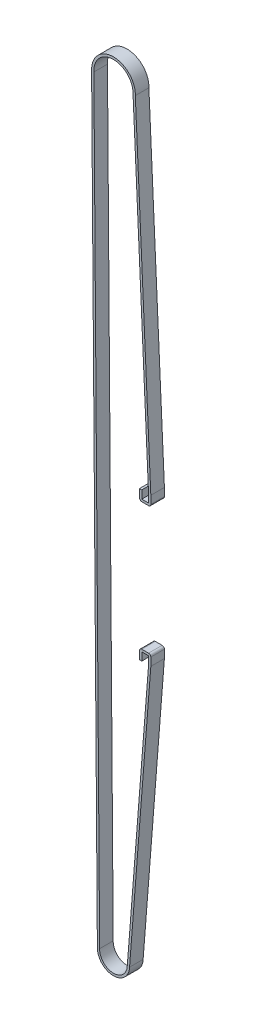
ISO-10303-21;
HEADER;
FILE_DESCRIPTION(('STEP AP214'),'2;1');
FILE_NAME('part.step','',(''),(''),'','','');
FILE_SCHEMA(('AUTOMOTIVE_DESIGN { 1 0 10303 214 1 1 1 1 }'));
ENDSEC;
DATA;
#1=APPLICATION_CONTEXT('core data for automotive mechanical design processes');
#2=APPLICATION_PROTOCOL_DEFINITION('international standard','automotive_design',2000,#1);
#3=PRODUCT_CONTEXT('',#1,'mechanical');
#4=PRODUCT('Part','Part','',(#3));
#5=PRODUCT_RELATED_PRODUCT_CATEGORY('part','',(#4));
#6=PRODUCT_DEFINITION_FORMATION('','',#4);
#7=PRODUCT_DEFINITION_CONTEXT('part definition',#1,'design');
#8=PRODUCT_DEFINITION('design','',#6,#7);
#9=PRODUCT_DEFINITION_SHAPE('','',#8);
#10=(LENGTH_UNIT() NAMED_UNIT(*) SI_UNIT(.MILLI.,.METRE.));
#11=(NAMED_UNIT(*) PLANE_ANGLE_UNIT() SI_UNIT($,.RADIAN.));
#12=(NAMED_UNIT(*) SI_UNIT($,.STERADIAN.) SOLID_ANGLE_UNIT());
#13=UNCERTAINTY_MEASURE_WITH_UNIT(LENGTH_MEASURE(1.E-05),#10,'distance_accuracy_value','');
#14=(GEOMETRIC_REPRESENTATION_CONTEXT(3) GLOBAL_UNCERTAINTY_ASSIGNED_CONTEXT((#13)) GLOBAL_UNIT_ASSIGNED_CONTEXT((#10,
#11,#12)) REPRESENTATION_CONTEXT('',''));
#15=CARTESIAN_POINT('',(0.,0.,0.));
#16=DIRECTION('',(0.,0.,1.));
#17=DIRECTION('',(1.,0.,0.));
#18=AXIS2_PLACEMENT_3D('',#15,#16,#17);
#19=CARTESIAN_POINT('',(49.3545558516404,0.375647011422282,66.5186934273262));
#20=DIRECTION('',(-0.999971036134917,-0.00761097176848917,0.));
#21=DIRECTION('',(0.00761097176848917,-0.999971036134917,0.));
#22=AXIS2_PLACEMENT_3D('',#19,#20,#21);
#23=PLANE('',#22);
#24=DIRECTION('',(0.,0.,1.));
#25=VECTOR('',#24,1.);
#26=CARTESIAN_POINT('',(50.9787372014678,-213.018168740484,66.5186934273254));
#27=LINE('',#26,#25);
#28=CARTESIAN_POINT('',(50.9787372014678,-213.018168740484,66.5186934273254));
#29=VERTEX_POINT('',#28);
#30=CARTESIAN_POINT('',(50.9787372014678,-213.018168740484,72.5186934273254));
#31=VERTEX_POINT('',#30);
#32=EDGE_CURVE('E221',#29,#31,#27,.T.);
#33=ORIENTED_EDGE('',*,*,#32,.T.);
#34=DIRECTION('',(0.00761097176848917,-0.999971036134917,0.));
#35=VECTOR('',#34,1.);
#36=CARTESIAN_POINT('',(49.3545558516404,0.375647011422261,72.5186934273262));
#37=LINE('',#36,#35);
#38=CARTESIAN_POINT('',(48.4304659183721,121.787629102586,72.5186934273266));
#39=VERTEX_POINT('',#38);
#40=EDGE_CURVE('E224',#39,#31,#37,.T.);
#41=ORIENTED_EDGE('',*,*,#40,.F.);
#42=DIRECTION('',(0.,0.,1.));
#43=VECTOR('',#42,1.);
#44=CARTESIAN_POINT('',(48.4304659183721,121.787629102586,66.5186934273266));
#45=LINE('',#44,#43);
#46=CARTESIAN_POINT('',(48.4304659183721,121.787629102586,66.5186934273266));
#47=VERTEX_POINT('',#46);
#48=EDGE_CURVE('E365',#47,#39,#45,.T.);
#49=ORIENTED_EDGE('',*,*,#48,.F.);
#50=DIRECTION('',(0.00761097176848917,-0.999971036134917,0.));
#51=VECTOR('',#50,1.);
#52=CARTESIAN_POINT('',(49.3545558516404,0.375647011422282,66.5186934273262));
#53=LINE('',#52,#51);
#54=EDGE_CURVE('E226',#47,#29,#53,.T.);
#55=ORIENTED_EDGE('',*,*,#54,.T.);
#56=EDGE_LOOP('',(#33,#41,#49,#55));
#57=FACE_BOUND('',#56,.T.);
#58=ADVANCED_FACE('F35',(#57),#23,.T.);
#59=CARTESIAN_POINT('',(58.0839171363472,121.431989422327,66.5186934273266));
#60=DIRECTION('',(0.,0.,1.));
#61=DIRECTION('',(0.,-1.,0.));
#62=AXIS2_PLACEMENT_3D('',#59,#60,#61);
#63=CYLINDRICAL_SURFACE('',#62,9.66);
#64=ORIENTED_EDGE('',*,*,#48,.T.);
#65=CARTESIAN_POINT('',(58.0839171363472,121.431989422327,72.5186934273266));
#66=DIRECTION('',(0.,0.,1.));
#67=DIRECTION('',(0.,-1.,0.));
#68=AXIS2_PLACEMENT_3D('',#65,#66,#67);
#69=CIRCLE('',#68,9.66);
#70=CARTESIAN_POINT('',(67.7373683543224,121.076349742068,72.5186934273266));
#71=VERTEX_POINT('',#70);
#72=EDGE_CURVE('E247',#71,#39,#69,.T.);
#73=ORIENTED_EDGE('',*,*,#72,.F.);
#74=DIRECTION('',(0.,0.,1.));
#75=VECTOR('',#74,1.);
#76=CARTESIAN_POINT('',(67.7373683543224,121.076349742068,66.5186934273266));
#77=LINE('',#76,#75);
#78=CARTESIAN_POINT('',(67.7373683543224,121.076349742068,66.5186934273266));
#79=VERTEX_POINT('',#78);
#80=EDGE_CURVE('E368',#79,#71,#77,.T.);
#81=ORIENTED_EDGE('',*,*,#80,.F.);
#82=CARTESIAN_POINT('',(58.0839171363472,121.431989422327,66.5186934273266));
#83=DIRECTION('',(0.,0.,1.));
#84=DIRECTION('',(0.,-1.,0.));
#85=AXIS2_PLACEMENT_3D('',#82,#83,#84);
#86=CIRCLE('',#85,9.66);
#87=EDGE_CURVE('E231',#79,#47,#86,.T.);
#88=ORIENTED_EDGE('',*,*,#87,.T.);
#89=EDGE_LOOP('',(#64,#73,#81,#88));
#90=FACE_BOUND('',#89,.T.);
#91=ADVANCED_FACE('F532',(#90),#63,.T.);
#92=CARTESIAN_POINT('',(73.1316105789095,3.35092983353367,66.5186934273262));
#93=DIRECTION('',(0.998951889201217,0.0457725142560279,0.));
#94=DIRECTION('',(-0.0457725142560279,0.998951889201218,0.));
#95=AXIS2_PLACEMENT_3D('',#92,#93,#94);
#96=PLANE('',#95);
#97=ORIENTED_EDGE('',*,*,#80,.T.);
#98=DIRECTION('',(-0.0457725142560279,0.998951889201218,0.));
#99=VECTOR('',#98,1.);
#100=CARTESIAN_POINT('',(73.1316105789095,3.35092983353365,72.5186934273262));
#101=LINE('',#100,#99);
#102=CARTESIAN_POINT('',(74.5839171363475,-28.3446062940457,72.5186934273261));
#103=VERTEX_POINT('',#102);
#104=EDGE_CURVE('E306',#103,#71,#101,.T.);
#105=ORIENTED_EDGE('',*,*,#104,.F.);
#106=DIRECTION('',(0.,0.,1.));
#107=VECTOR('',#106,1.);
#108=CARTESIAN_POINT('',(74.5839171363475,-28.3446062940457,66.5186934273261));
#109=LINE('',#108,#107);
#110=CARTESIAN_POINT('',(74.5839171363475,-28.3446062940457,66.5186934273261));
#111=VERTEX_POINT('',#110);
#112=EDGE_CURVE('E370',#111,#103,#109,.T.);
#113=ORIENTED_EDGE('',*,*,#112,.F.);
#114=DIRECTION('',(-0.0457725142560279,0.998951889201218,0.));
#115=VECTOR('',#114,1.);
#116=CARTESIAN_POINT('',(73.1316105789095,3.35092983353367,66.5186934273262));
#117=LINE('',#116,#115);
#118=EDGE_CURVE('E360',#111,#79,#117,.T.);
#119=ORIENTED_EDGE('',*,*,#118,.T.);
#120=EDGE_LOOP('',(#97,#105,#113,#119));
#121=FACE_BOUND('',#120,.T.);
#122=ADVANCED_FACE('F536',(#121),#96,.T.);
#123=CARTESIAN_POINT('',(74.5839171363475,0.,66.5186934273262));
#124=DIRECTION('',(1.,0.,0.));
#125=DIRECTION('',(0.,1.,0.));
#126=AXIS2_PLACEMENT_3D('',#123,#124,#125);
#127=PLANE('',#126);
#128=DIRECTION('',(0.,1.,0.));
#129=VECTOR('',#128,1.);
#130=CARTESIAN_POINT('',(74.5839171363475,0.,72.5186934273262));
#131=LINE('',#130,#129);
#132=CARTESIAN_POINT('',(74.5839171363475,-31.8299283809652,72.5186934273261));
#133=VERTEX_POINT('',#132);
#134=EDGE_CURVE('E304',#133,#103,#131,.T.);
#135=ORIENTED_EDGE('',*,*,#134,.F.);
#136=DIRECTION('',(0.,0.,1.));
#137=VECTOR('',#136,1.);
#138=CARTESIAN_POINT('',(74.5839171363475,-31.8299283809652,66.5186934273261));
#139=LINE('',#138,#137);
#140=CARTESIAN_POINT('',(74.5839171363475,-31.8299283809652,66.5186934273261));
#141=VERTEX_POINT('',#140);
#142=EDGE_CURVE('E11',#133,#141,#139,.F.);
#143=ORIENTED_EDGE('',*,*,#142,.T.);
#144=DIRECTION('',(0.,1.,0.));
#145=VECTOR('',#144,1.);
#146=CARTESIAN_POINT('',(74.5839171363475,0.,66.5186934273262));
#147=LINE('',#146,#145);
#148=EDGE_CURVE('E358',#141,#111,#147,.T.);
#149=ORIENTED_EDGE('',*,*,#148,.T.);
#150=ORIENTED_EDGE('',*,*,#112,.T.);
#151=EDGE_LOOP('',(#135,#143,#149,#150));
#152=FACE_BOUND('',#151,.T.);
#153=ADVANCED_FACE('F541',(#152),#127,.T.);
#154=CARTESIAN_POINT('',(1.82279723997927E-13,-32.8299283809656,66.5186934273261));
#155=DIRECTION('',(0.,-1.,0.));
#156=DIRECTION('',(1.,0.,0.));
#157=AXIS2_PLACEMENT_3D('',#154,#155,#156);
#158=PLANE('',#157);
#159=DIRECTION('',(1.,0.,0.));
#160=VECTOR('',#159,1.);
#161=CARTESIAN_POINT('',(1.822056998555E-13,-32.8299283809656,72.5186934273261));
#162=LINE('',#161,#160);
#163=CARTESIAN_POINT('',(70.5839171363476,-32.8299283809652,72.5186934273261));
#164=VERTEX_POINT('',#163);
#165=CARTESIAN_POINT('',(73.5839171363475,-32.8299283809652,72.5186934273261));
#166=VERTEX_POINT('',#165);
#167=EDGE_CURVE('E301',#164,#166,#162,.T.);
#168=ORIENTED_EDGE('',*,*,#167,.F.);
#169=DIRECTION('',(0.,0.,1.));
#170=VECTOR('',#169,1.);
#171=CARTESIAN_POINT('',(70.5839171363476,-32.8299283809652,66.5186934273261));
#172=LINE('',#171,#170);
#173=CARTESIAN_POINT('',(70.5839171363476,-32.8299283809652,66.5186934273261));
#174=VERTEX_POINT('',#173);
#175=EDGE_CURVE('E43',#164,#174,#172,.F.);
#176=ORIENTED_EDGE('',*,*,#175,.T.);
#177=DIRECTION('',(1.,0.,0.));
#178=VECTOR('',#177,1.);
#179=CARTESIAN_POINT('',(1.82279723997927E-13,-32.8299283809656,66.5186934273261));
#180=LINE('',#179,#178);
#181=CARTESIAN_POINT('',(73.5839171363475,-32.8299283809652,66.5186934273261));
#182=VERTEX_POINT('',#181);
#183=EDGE_CURVE('E355',#174,#182,#180,.T.);
#184=ORIENTED_EDGE('',*,*,#183,.T.);
#185=DIRECTION('',(0.,0.,1.));
#186=VECTOR('',#185,1.);
#187=CARTESIAN_POINT('',(73.5839171363475,-32.8299283809652,66.5186934273261));
#188=LINE('',#187,#186);
#189=EDGE_CURVE('E431',#182,#166,#188,.T.);
#190=ORIENTED_EDGE('',*,*,#189,.T.);
#191=EDGE_LOOP('',(#168,#176,#184,#190));
#192=FACE_BOUND('',#191,.T.);
#193=ADVANCED_FACE('F436',(#192),#158,.T.);
#194=CARTESIAN_POINT('',(69.5839171363476,-2.32212261237888E-13,66.5186934273262));
#195=DIRECTION('',(-1.,0.,0.));
#196=DIRECTION('',(0.,0.,1.));
#197=AXIS2_PLACEMENT_3D('',#194,#195,#196);
#198=PLANE('',#197);
#199=DIRECTION('',(0.,-1.,0.));
#200=VECTOR('',#199,1.);
#201=CARTESIAN_POINT('',(69.5839171363476,-2.32212261237888E-13,66.5186934273262));
#202=LINE('',#201,#200);
#203=CARTESIAN_POINT('',(69.5839171363476,-28.2799283809651,66.5186934273261));
#204=VERTEX_POINT('',#203);
#205=CARTESIAN_POINT('',(69.5839171363476,-31.8299283809652,66.5186934273261));
#206=VERTEX_POINT('',#205);
#207=EDGE_CURVE('E353',#204,#206,#202,.T.);
#208=ORIENTED_EDGE('',*,*,#207,.T.);
#209=DIRECTION('',(0.,0.,1.));
#210=VECTOR('',#209,1.);
#211=CARTESIAN_POINT('',(69.5839171363476,-31.8299283809652,66.5186934273261));
#212=LINE('',#211,#210);
#213=CARTESIAN_POINT('',(69.5839171363476,-31.8299283809652,72.5186934273261));
#214=VERTEX_POINT('',#213);
#215=EDGE_CURVE('E428',#206,#214,#212,.T.);
#216=ORIENTED_EDGE('',*,*,#215,.T.);
#217=DIRECTION('',(0.,-1.,0.));
#218=VECTOR('',#217,1.);
#219=CARTESIAN_POINT('',(69.5839171363476,-2.53184318683104E-13,72.5186934273262));
#220=LINE('',#219,#218);
#221=CARTESIAN_POINT('',(69.5839171363476,-28.2799283809652,72.5186934273261));
#222=VERTEX_POINT('',#221);
#223=EDGE_CURVE('E298',#222,#214,#220,.T.);
#224=ORIENTED_EDGE('',*,*,#223,.F.);
#225=DIRECTION('',(0.,0.,1.));
#226=VECTOR('',#225,1.);
#227=CARTESIAN_POINT('',(69.5839171363476,-28.2799283809651,66.5186934273261));
#228=LINE('',#227,#226);
#229=EDGE_CURVE('E373',#204,#222,#228,.T.);
#230=ORIENTED_EDGE('',*,*,#229,.F.);
#231=EDGE_LOOP('',(#208,#216,#224,#230));
#232=FACE_BOUND('',#231,.T.);
#233=ADVANCED_FACE('F446',(#232),#198,.T.);
#234=CARTESIAN_POINT('',(-1.56981436909345E-12,-28.2799283809613,66.5186934273261));
#235=DIRECTION('',(0.,1.,0.));
#236=DIRECTION('',(-1.,0.,0.));
#237=AXIS2_PLACEMENT_3D('',#234,#235,#236);
#238=PLANE('',#237);
#239=ORIENTED_EDGE('',*,*,#229,.T.);
#240=DIRECTION('',(-1.,0.,0.));
#241=VECTOR('',#240,1.);
#242=CARTESIAN_POINT('',(-1.56988839323588E-12,-28.2799283809613,72.5186934273261));
#243=LINE('',#242,#241);
#244=CARTESIAN_POINT('',(70.5839171363476,-28.2799283809652,72.5186934273261));
#245=VERTEX_POINT('',#244);
#246=EDGE_CURVE('E295',#245,#222,#243,.T.);
#247=ORIENTED_EDGE('',*,*,#246,.F.);
#248=DIRECTION('',(0.,0.,1.));
#249=VECTOR('',#248,1.);
#250=CARTESIAN_POINT('',(70.5839171363476,-28.2799283809652,66.5186934273261));
#251=LINE('',#250,#249);
#252=CARTESIAN_POINT('',(70.5839171363476,-28.2799283809652,66.5186934273261));
#253=VERTEX_POINT('',#252);
#254=EDGE_CURVE('E375',#253,#245,#251,.T.);
#255=ORIENTED_EDGE('',*,*,#254,.F.);
#256=DIRECTION('',(-1.,0.,0.));
#257=VECTOR('',#256,1.);
#258=CARTESIAN_POINT('',(-1.56981436909345E-12,-28.2799283809613,66.5186934273261));
#259=LINE('',#258,#257);
#260=EDGE_CURVE('E350',#253,#204,#259,.T.);
#261=ORIENTED_EDGE('',*,*,#260,.T.);
#262=EDGE_LOOP('',(#239,#247,#255,#261));
#263=FACE_BOUND('',#262,.T.);
#264=ADVANCED_FACE('F450',(#263),#238,.T.);
#265=CARTESIAN_POINT('',(70.5839171363481,-1.6118582114669E-12,66.5186934273262));
#266=DIRECTION('',(1.,0.,0.));
#267=DIRECTION('',(0.,1.,0.));
#268=AXIS2_PLACEMENT_3D('',#265,#266,#267);
#269=PLANE('',#268);
#270=ORIENTED_EDGE('',*,*,#254,.T.);
#271=DIRECTION('',(0.,1.,0.));
#272=VECTOR('',#271,1.);
#273=CARTESIAN_POINT('',(70.5839171363481,-1.63283026891212E-12,72.5186934273262));
#274=LINE('',#273,#272);
#275=CARTESIAN_POINT('',(70.5839171363475,-31.8299283809652,72.5186934273261));
#276=VERTEX_POINT('',#275);
#277=EDGE_CURVE('E292',#276,#245,#274,.T.);
#278=ORIENTED_EDGE('',*,*,#277,.F.);
#279=DIRECTION('',(0.,0.,1.));
#280=VECTOR('',#279,1.);
#281=CARTESIAN_POINT('',(70.5839171363475,-31.8299283809652,66.5186934273261));
#282=LINE('',#281,#280);
#283=CARTESIAN_POINT('',(70.5839171363475,-31.8299283809652,66.5186934273261));
#284=VERTEX_POINT('',#283);
#285=EDGE_CURVE('E377',#284,#276,#282,.T.);
#286=ORIENTED_EDGE('',*,*,#285,.F.);
#287=DIRECTION('',(0.,1.,0.));
#288=VECTOR('',#287,1.);
#289=CARTESIAN_POINT('',(70.5839171363481,-1.6118582114669E-12,66.5186934273262));
#290=LINE('',#289,#288);
#291=EDGE_CURVE('E347',#284,#253,#290,.T.);
#292=ORIENTED_EDGE('',*,*,#291,.T.);
#293=EDGE_LOOP('',(#270,#278,#286,#292));
#294=FACE_BOUND('',#293,.T.);
#295=ADVANCED_FACE('F455',(#294),#269,.T.);
#296=CARTESIAN_POINT('',(0.,-31.8299283809652,66.5186934273261));
#297=DIRECTION('',(0.,1.,0.));
#298=DIRECTION('',(0.,0.,1.));
#299=AXIS2_PLACEMENT_3D('',#296,#297,#298);
#300=PLANE('',#299);
#301=ORIENTED_EDGE('',*,*,#285,.T.);
#302=DIRECTION('',(-1.,0.,0.));
#303=VECTOR('',#302,1.);
#304=CARTESIAN_POINT('',(0.,-31.8299283809652,72.5186934273261));
#305=LINE('',#304,#303);
#306=CARTESIAN_POINT('',(73.5839171363475,-31.8299283809652,72.5186934273261));
#307=VERTEX_POINT('',#306);
#308=EDGE_CURVE('E289',#307,#276,#305,.T.);
#309=ORIENTED_EDGE('',*,*,#308,.F.);
#310=DIRECTION('',(0.,0.,1.));
#311=VECTOR('',#310,1.);
#312=CARTESIAN_POINT('',(73.5839171363475,-31.8299283809652,66.5186934273261));
#313=LINE('',#312,#311);
#314=CARTESIAN_POINT('',(73.5839171363475,-31.8299283809652,66.5186934273261));
#315=VERTEX_POINT('',#314);
#316=EDGE_CURVE('E379',#315,#307,#313,.T.);
#317=ORIENTED_EDGE('',*,*,#316,.F.);
#318=DIRECTION('',(-1.,0.,0.));
#319=VECTOR('',#318,1.);
#320=CARTESIAN_POINT('',(0.,-31.8299283809652,66.5186934273261));
#321=LINE('',#320,#319);
#322=EDGE_CURVE('E344',#315,#284,#321,.T.);
#323=ORIENTED_EDGE('',*,*,#322,.T.);
#324=EDGE_LOOP('',(#301,#309,#317,#323));
#325=FACE_BOUND('',#324,.T.);
#326=ADVANCED_FACE('F458',(#325),#300,.T.);
#327=CARTESIAN_POINT('',(73.5839171363481,-1.67049675149992E-12,66.5186934273262));
#328=DIRECTION('',(-1.,0.,0.));
#329=DIRECTION('',(0.,-1.,0.));
#330=AXIS2_PLACEMENT_3D('',#327,#328,#329);
#331=PLANE('',#330);
#332=ORIENTED_EDGE('',*,*,#316,.T.);
#333=DIRECTION('',(0.,-1.,0.));
#334=VECTOR('',#333,1.);
#335=CARTESIAN_POINT('',(73.5839171363481,-1.69146880894514E-12,72.5186934273262));
#336=LINE('',#335,#334);
#337=CARTESIAN_POINT('',(73.5839171363475,-28.2799283809652,72.5186934273261));
#338=VERTEX_POINT('',#337);
#339=EDGE_CURVE('E286',#338,#307,#336,.T.);
#340=ORIENTED_EDGE('',*,*,#339,.F.);
#341=DIRECTION('',(0.,0.,1.));
#342=VECTOR('',#341,1.);
#343=CARTESIAN_POINT('',(73.5839171363475,-28.2799283809652,66.5186934273261));
#344=LINE('',#343,#342);
#345=CARTESIAN_POINT('',(73.5839171363475,-28.2799283809652,66.5186934273261));
#346=VERTEX_POINT('',#345);
#347=EDGE_CURVE('E381',#346,#338,#344,.T.);
#348=ORIENTED_EDGE('',*,*,#347,.F.);
#349=DIRECTION('',(0.,-1.,0.));
#350=VECTOR('',#349,1.);
#351=CARTESIAN_POINT('',(73.5839171363481,-1.67049675149992E-12,66.5186934273262));
#352=LINE('',#351,#350);
#353=EDGE_CURVE('E341',#346,#315,#352,.T.);
#354=ORIENTED_EDGE('',*,*,#353,.T.);
#355=EDGE_LOOP('',(#332,#340,#348,#354));
#356=FACE_BOUND('',#355,.T.);
#357=ADVANCED_FACE('F463',(#356),#331,.T.);
#358=CARTESIAN_POINT('',(72.1362158655848,3.3062468217902,66.5186934273262));
#359=DIRECTION('',(-0.998951302453346,-0.0457853178078266,0.));
#360=DIRECTION('',(0.0457853178078266,-0.998951302453346,0.));
#361=AXIS2_PLACEMENT_3D('',#358,#359,#360);
#362=PLANE('',#361);
#363=ORIENTED_EDGE('',*,*,#347,.T.);
#364=DIRECTION('',(0.0457853178078266,-0.998951302453346,0.));
#365=VECTOR('',#364,1.);
#366=CARTESIAN_POINT('',(72.1362158655848,3.30624682179018,72.5186934273262));
#367=LINE('',#366,#365);
#368=CARTESIAN_POINT('',(66.7367239922389,121.113214158011,72.5186934273266));
#369=VERTEX_POINT('',#368);
#370=EDGE_CURVE('E283',#369,#338,#367,.T.);
#371=ORIENTED_EDGE('',*,*,#370,.F.);
#372=DIRECTION('',(0.,0.,1.));
#373=VECTOR('',#372,1.);
#374=CARTESIAN_POINT('',(66.7367239922389,121.113214158011,66.5186934273266));
#375=LINE('',#374,#373);
#376=CARTESIAN_POINT('',(66.7367239922389,121.113214158011,66.5186934273266));
#377=VERTEX_POINT('',#376);
#378=EDGE_CURVE('E383',#377,#369,#375,.T.);
#379=ORIENTED_EDGE('',*,*,#378,.F.);
#380=DIRECTION('',(0.0457853178078266,-0.998951302453346,0.));
#381=VECTOR('',#380,1.);
#382=CARTESIAN_POINT('',(72.1362158655848,3.3062468217902,66.5186934273262));
#383=LINE('',#382,#381);
#384=EDGE_CURVE('E338',#377,#346,#383,.T.);
#385=ORIENTED_EDGE('',*,*,#384,.T.);
#386=EDGE_LOOP('',(#363,#371,#379,#385));
#387=FACE_BOUND('',#386,.T.);
#388=ADVANCED_FACE('F467',(#387),#362,.T.);
#389=CARTESIAN_POINT('',(58.0839171363472,121.431989422327,66.5186934273266));
#390=DIRECTION('',(0.,0.,1.));
#391=DIRECTION('',(0.,-1.,0.));
#392=AXIS2_PLACEMENT_3D('',#389,#390,#391);
#393=CYLINDRICAL_SURFACE('',#392,8.6586768131456);
#394=ORIENTED_EDGE('',*,*,#378,.T.);
#395=CARTESIAN_POINT('',(58.0839171363472,121.431989422327,72.5186934273266));
#396=DIRECTION('',(0.,0.,1.));
#397=DIRECTION('',(0.,-1.,0.));
#398=AXIS2_PLACEMENT_3D('',#395,#396,#397);
#399=CIRCLE('',#398,8.6586768131456);
#400=CARTESIAN_POINT('',(49.436964917062,120.981543563312,72.5186934273266));
#401=VERTEX_POINT('',#400);
#402=EDGE_CURVE('E280',#369,#401,#399,.T.);
#403=ORIENTED_EDGE('',*,*,#402,.T.);
#404=DIRECTION('',(0.,0.,1.));
#405=VECTOR('',#404,1.);
#406=CARTESIAN_POINT('',(49.436964917062,120.981543563312,66.5186934273266));
#407=LINE('',#406,#405);
#408=CARTESIAN_POINT('',(49.436964917062,120.981543563312,66.5186934273266));
#409=VERTEX_POINT('',#408);
#410=EDGE_CURVE('E385',#409,#401,#407,.T.);
#411=ORIENTED_EDGE('',*,*,#410,.F.);
#412=CARTESIAN_POINT('',(58.0839171363472,121.431989422327,66.5186934273266));
#413=DIRECTION('',(0.,0.,1.));
#414=DIRECTION('',(0.,-1.,0.));
#415=AXIS2_PLACEMENT_3D('',#412,#413,#414);
#416=CIRCLE('',#415,8.6586768131456);
#417=EDGE_CURVE('E336',#377,#409,#416,.T.);
#418=ORIENTED_EDGE('',*,*,#417,.F.);
#419=EDGE_LOOP('',(#394,#403,#411,#418));
#420=FACE_BOUND('',#419,.T.);
#421=ADVANCED_FACE('F471',(#420),#393,.F.);
#422=CARTESIAN_POINT('',(50.3548533133488,0.383256983692733,66.5186934273262));
#423=DIRECTION('',(0.999971036661477,0.00761090258582103,0.));
#424=DIRECTION('',(-0.00761090258582103,0.999971036661477,0.));
#425=AXIS2_PLACEMENT_3D('',#422,#423,#424);
#426=PLANE('',#425);
#427=ORIENTED_EDGE('',*,*,#410,.T.);
#428=DIRECTION('',(-0.00761090258582103,0.999971036661477,0.));
#429=VECTOR('',#428,1.);
#430=CARTESIAN_POINT('',(50.3548533133488,0.383256983692712,72.5186934273262));
#431=LINE('',#430,#429);
#432=CARTESIAN_POINT('',(51.979358392283,-213.055032302782,72.5186934273254));
#433=VERTEX_POINT('',#432);
#434=EDGE_CURVE('E277',#433,#401,#431,.T.);
#435=ORIENTED_EDGE('',*,*,#434,.F.);
#436=DIRECTION('',(0.,0.,1.));
#437=VECTOR('',#436,1.);
#438=CARTESIAN_POINT('',(51.979358392283,-213.055032302782,66.5186934273254));
#439=LINE('',#438,#437);
#440=CARTESIAN_POINT('',(51.979358392283,-213.055032302782,66.5186934273254));
#441=VERTEX_POINT('',#440);
#442=EDGE_CURVE('E387',#441,#433,#439,.T.);
#443=ORIENTED_EDGE('',*,*,#442,.F.);
#444=DIRECTION('',(-0.00761090258582103,0.999971036661477,0.));
#445=VECTOR('',#444,1.);
#446=CARTESIAN_POINT('',(50.3548533133488,0.383256983692733,66.5186934273262));
#447=LINE('',#446,#445);
#448=EDGE_CURVE('E333',#441,#409,#447,.T.);
#449=ORIENTED_EDGE('',*,*,#448,.T.);
#450=EDGE_LOOP('',(#427,#435,#443,#449));
#451=FACE_BOUND('',#450,.T.);
#452=ADVANCED_FACE('F476',(#451),#426,.T.);
#453=CARTESIAN_POINT('',(58.0839171363468,-213.279928380965,66.5186934273254));
#454=DIRECTION('',(0.,0.,1.));
#455=DIRECTION('',(0.,-1.,0.));
#456=AXIS2_PLACEMENT_3D('',#453,#454,#455);
#457=CYLINDRICAL_SURFACE('',#456,6.10870000128574);
#458=ORIENTED_EDGE('',*,*,#442,.T.);
#459=CARTESIAN_POINT('',(58.0839171363468,-213.279928380965,72.5186934273254));
#460=DIRECTION('',(0.,0.,1.));
#461=DIRECTION('',(0.,-1.,0.));
#462=AXIS2_PLACEMENT_3D('',#459,#460,#461);
#463=CIRCLE('',#462,6.10870000128574);
#464=CARTESIAN_POINT('',(64.1884758804106,-213.504824459149,72.5186934273254));
#465=VERTEX_POINT('',#464);
#466=EDGE_CURVE('E274',#433,#465,#463,.T.);
#467=ORIENTED_EDGE('',*,*,#466,.T.);
#468=DIRECTION('',(0.,0.,1.));
#469=VECTOR('',#468,1.);
#470=CARTESIAN_POINT('',(64.1884758804106,-213.504824459149,66.5186934273254));
#471=LINE('',#470,#469);
#472=CARTESIAN_POINT('',(64.1884758804106,-213.504824459149,66.5186934273254));
#473=VERTEX_POINT('',#472);
#474=EDGE_CURVE('E389',#473,#465,#471,.T.);
#475=ORIENTED_EDGE('',*,*,#474,.F.);
#476=CARTESIAN_POINT('',(58.0839171363468,-213.279928380965,66.5186934273254));
#477=DIRECTION('',(0.,0.,1.));
#478=DIRECTION('',(0.,-1.,0.));
#479=AXIS2_PLACEMENT_3D('',#476,#477,#478);
#480=CIRCLE('',#479,6.10870000128574);
#481=EDGE_CURVE('E331',#441,#473,#480,.T.);
#482=ORIENTED_EDGE('',*,*,#481,.F.);
#483=EDGE_LOOP('',(#458,#467,#475,#482));
#484=FACE_BOUND('',#483,.T.);
#485=ADVANCED_FACE('F480',(#484),#457,.F.);
#486=CARTESIAN_POINT('',(80.4478930543302,-6.31316858995058,66.5186934273262));
#487=DIRECTION('',(0.99693496695121,-0.0782347216393729,0.));
#488=DIRECTION('',(0.0782347216393729,0.99693496695121,0.));
#489=AXIS2_PLACEMENT_3D('',#486,#487,#488);
#490=PLANE('',#489);
#491=ORIENTED_EDGE('',*,*,#474,.T.);
#492=DIRECTION('',(0.0782347216393729,0.99693496695121,0.));
#493=VECTOR('',#492,1.);
#494=CARTESIAN_POINT('',(80.4478930543302,-6.3131685899506,72.5186934273262));
#495=LINE('',#494,#493);
#496=CARTESIAN_POINT('',(73.5839171363476,-93.7799283809653,72.5186934273259));
#497=VERTEX_POINT('',#496);
#498=EDGE_CURVE('E271',#465,#497,#495,.T.);
#499=ORIENTED_EDGE('',*,*,#498,.T.);
#500=DIRECTION('',(0.,0.,1.));
#501=VECTOR('',#500,1.);
#502=CARTESIAN_POINT('',(73.5839171363476,-93.7799283809652,66.5186934273258));
#503=LINE('',#502,#501);
#504=CARTESIAN_POINT('',(73.5839171363476,-93.7799283809652,66.5186934273258));
#505=VERTEX_POINT('',#504);
#506=EDGE_CURVE('E391',#505,#497,#503,.T.);
#507=ORIENTED_EDGE('',*,*,#506,.F.);
#508=DIRECTION('',(0.0782347216393729,0.99693496695121,0.));
#509=VECTOR('',#508,1.);
#510=CARTESIAN_POINT('',(80.4478930543302,-6.31316858995058,66.5186934273262));
#511=LINE('',#510,#509);
#512=EDGE_CURVE('E329',#473,#505,#511,.T.);
#513=ORIENTED_EDGE('',*,*,#512,.F.);
#514=EDGE_LOOP('',(#491,#499,#507,#513));
#515=FACE_BOUND('',#514,.T.);
#516=ADVANCED_FACE('F485',(#515),#490,.F.);
#517=CARTESIAN_POINT('',(73.5839171363457,1.20607222902408E-12,66.5186934273262));
#518=DIRECTION('',(1.,0.,0.));
#519=DIRECTION('',(0.,1.,0.));
#520=AXIS2_PLACEMENT_3D('',#517,#518,#519);
#521=PLANE('',#520);
#522=ORIENTED_EDGE('',*,*,#506,.T.);
#523=DIRECTION('',(0.,1.,0.));
#524=VECTOR('',#523,1.);
#525=CARTESIAN_POINT('',(73.5839171363457,1.18510017157887E-12,72.5186934273262));
#526=LINE('',#525,#524);
#527=CARTESIAN_POINT('',(73.5839171363475,-90.2299283809652,72.5186934273259));
#528=VERTEX_POINT('',#527);
#529=EDGE_CURVE('E268',#497,#528,#526,.T.);
#530=ORIENTED_EDGE('',*,*,#529,.T.);
#531=DIRECTION('',(0.,0.,1.));
#532=VECTOR('',#531,1.);
#533=CARTESIAN_POINT('',(73.5839171363475,-90.2299283809652,66.5186934273259));
#534=LINE('',#533,#532);
#535=CARTESIAN_POINT('',(73.5839171363475,-90.2299283809652,66.5186934273259));
#536=VERTEX_POINT('',#535);
#537=EDGE_CURVE('E393',#536,#528,#534,.T.);
#538=ORIENTED_EDGE('',*,*,#537,.F.);
#539=DIRECTION('',(0.,1.,0.));
#540=VECTOR('',#539,1.);
#541=CARTESIAN_POINT('',(73.5839171363457,1.20607222902408E-12,66.5186934273262));
#542=LINE('',#541,#540);
#543=EDGE_CURVE('E327',#505,#536,#542,.T.);
#544=ORIENTED_EDGE('',*,*,#543,.F.);
#545=EDGE_LOOP('',(#522,#530,#538,#544));
#546=FACE_BOUND('',#545,.T.);
#547=ADVANCED_FACE('F491',(#546),#521,.F.);
#548=CARTESIAN_POINT('',(0.,-90.2299283809652,66.5186934273259));
#549=DIRECTION('',(0.,1.,0.));
#550=DIRECTION('',(0.,0.,1.));
#551=AXIS2_PLACEMENT_3D('',#548,#549,#550);
#552=PLANE('',#551);
#553=ORIENTED_EDGE('',*,*,#537,.T.);
#554=DIRECTION('',(-1.,0.,0.));
#555=VECTOR('',#554,1.);
#556=CARTESIAN_POINT('',(0.,-90.2299283809652,72.5186934273259));
#557=LINE('',#556,#555);
#558=CARTESIAN_POINT('',(70.5839171363476,-90.2299283809652,72.5186934273259));
#559=VERTEX_POINT('',#558);
#560=EDGE_CURVE('E265',#528,#559,#557,.T.);
#561=ORIENTED_EDGE('',*,*,#560,.T.);
#562=DIRECTION('',(0.,0.,1.));
#563=VECTOR('',#562,1.);
#564=CARTESIAN_POINT('',(70.5839171363476,-90.2299283809652,66.5186934273259));
#565=LINE('',#564,#563);
#566=CARTESIAN_POINT('',(70.5839171363476,-90.2299283809652,66.5186934273259));
#567=VERTEX_POINT('',#566);
#568=EDGE_CURVE('E395',#567,#559,#565,.T.);
#569=ORIENTED_EDGE('',*,*,#568,.F.);
#570=DIRECTION('',(-1.,0.,0.));
#571=VECTOR('',#570,1.);
#572=CARTESIAN_POINT('',(0.,-90.2299283809652,66.5186934273259));
#573=LINE('',#572,#571);
#574=EDGE_CURVE('E325',#536,#567,#573,.T.);
#575=ORIENTED_EDGE('',*,*,#574,.F.);
#576=EDGE_LOOP('',(#553,#561,#569,#575));
#577=FACE_BOUND('',#576,.T.);
#578=ADVANCED_FACE('F495',(#577),#552,.F.);
#579=CARTESIAN_POINT('',(70.5839171363486,-1.0599998313753E-12,66.5186934273262));
#580=DIRECTION('',(-1.,0.,0.));
#581=DIRECTION('',(0.,-1.,0.));
#582=AXIS2_PLACEMENT_3D('',#579,#580,#581);
#583=PLANE('',#582);
#584=ORIENTED_EDGE('',*,*,#568,.T.);
#585=DIRECTION('',(0.,-1.,0.));
#586=VECTOR('',#585,1.);
#587=CARTESIAN_POINT('',(70.5839171363486,-1.08097188882051E-12,72.5186934273262));
#588=LINE('',#587,#586);
#589=CARTESIAN_POINT('',(70.5839171363476,-93.7799283809652,72.5186934273259));
#590=VERTEX_POINT('',#589);
#591=EDGE_CURVE('E262',#559,#590,#588,.T.);
#592=ORIENTED_EDGE('',*,*,#591,.T.);
#593=DIRECTION('',(0.,0.,1.));
#594=VECTOR('',#593,1.);
#595=CARTESIAN_POINT('',(70.5839171363476,-93.7799283809652,66.5186934273258));
#596=LINE('',#595,#594);
#597=CARTESIAN_POINT('',(70.5839171363476,-93.7799283809652,66.5186934273258));
#598=VERTEX_POINT('',#597);
#599=EDGE_CURVE('E397',#598,#590,#596,.T.);
#600=ORIENTED_EDGE('',*,*,#599,.F.);
#601=DIRECTION('',(0.,-1.,0.));
#602=VECTOR('',#601,1.);
#603=CARTESIAN_POINT('',(70.5839171363486,-1.0599998313753E-12,66.5186934273262));
#604=LINE('',#603,#602);
#605=EDGE_CURVE('E323',#567,#598,#604,.T.);
#606=ORIENTED_EDGE('',*,*,#605,.F.);
#607=EDGE_LOOP('',(#584,#592,#600,#606));
#608=FACE_BOUND('',#607,.T.);
#609=ADVANCED_FACE('F500',(#608),#583,.F.);
#610=CARTESIAN_POINT('',(-2.60111429243061E-12,-93.7799283809633,66.5186934273258));
#611=DIRECTION('',(0.,1.,0.));
#612=DIRECTION('',(-1.,0.,0.));
#613=AXIS2_PLACEMENT_3D('',#610,#611,#612);
#614=PLANE('',#613);
#615=ORIENTED_EDGE('',*,*,#599,.T.);
#616=DIRECTION('',(-1.,0.,0.));
#617=VECTOR('',#616,1.);
#618=CARTESIAN_POINT('',(-2.60118831657304E-12,-93.7799283809633,72.5186934273259));
#619=LINE('',#618,#617);
#620=CARTESIAN_POINT('',(69.5832387487039,-93.7799283809652,72.5186934273259));
#621=VERTEX_POINT('',#620);
#622=EDGE_CURVE('E259',#590,#621,#619,.T.);
#623=ORIENTED_EDGE('',*,*,#622,.T.);
#624=DIRECTION('',(0.,0.,1.));
#625=VECTOR('',#624,1.);
#626=CARTESIAN_POINT('',(69.5832387487039,-93.7799283809652,66.5186934273258));
#627=LINE('',#626,#625);
#628=CARTESIAN_POINT('',(69.5832387487039,-93.7799283809652,66.5186934273258));
#629=VERTEX_POINT('',#628);
#630=EDGE_CURVE('E399',#629,#621,#627,.T.);
#631=ORIENTED_EDGE('',*,*,#630,.F.);
#632=DIRECTION('',(-1.,0.,0.));
#633=VECTOR('',#632,1.);
#634=CARTESIAN_POINT('',(-2.60111429243061E-12,-93.7799283809633,66.5186934273258));
#635=LINE('',#634,#633);
#636=EDGE_CURVE('E321',#598,#629,#635,.T.);
#637=ORIENTED_EDGE('',*,*,#636,.F.);
#638=EDGE_LOOP('',(#615,#623,#631,#637));
#639=FACE_BOUND('',#638,.T.);
#640=ADVANCED_FACE('F506',(#639),#614,.F.);
#641=CARTESIAN_POINT('',(69.5832387487039,-2.32212261237888E-13,66.5186934273262));
#642=DIRECTION('',(1.,0.,0.));
#643=DIRECTION('',(0.,0.,-1.));
#644=AXIS2_PLACEMENT_3D('',#641,#642,#643);
#645=PLANE('',#644);
#646=DIRECTION('',(0.,1.,0.));
#647=VECTOR('',#646,1.);
#648=CARTESIAN_POINT('',(69.5832387487039,-2.53184318683104E-13,72.5186934273262));
#649=LINE('',#648,#647);
#650=CARTESIAN_POINT('',(69.5832387487039,-90.2299283809652,72.5186934273259));
#651=VERTEX_POINT('',#650);
#652=EDGE_CURVE('E256',#621,#651,#649,.T.);
#653=ORIENTED_EDGE('',*,*,#652,.T.);
#654=DIRECTION('',(0.,0.,1.));
#655=VECTOR('',#654,1.);
#656=CARTESIAN_POINT('',(69.5832387487039,-90.2299283809652,66.5186934273259));
#657=LINE('',#656,#655);
#658=CARTESIAN_POINT('',(69.5832387487039,-90.2299283809652,66.5186934273259));
#659=VERTEX_POINT('',#658);
#660=EDGE_CURVE('E417',#651,#659,#657,.F.);
#661=ORIENTED_EDGE('',*,*,#660,.T.);
#662=DIRECTION('',(0.,1.,0.));
#663=VECTOR('',#662,1.);
#664=CARTESIAN_POINT('',(69.5832387487039,-2.32212261237888E-13,66.5186934273262));
#665=LINE('',#664,#663);
#666=EDGE_CURVE('E318',#629,#659,#665,.T.);
#667=ORIENTED_EDGE('',*,*,#666,.F.);
#668=ORIENTED_EDGE('',*,*,#630,.T.);
#669=EDGE_LOOP('',(#653,#661,#667,#668));
#670=FACE_BOUND('',#669,.T.);
#671=ADVANCED_FACE('F510',(#670),#645,.F.);
#672=CARTESIAN_POINT('',(0.,-89.2299283809652,66.5186934273259));
#673=DIRECTION('',(0.,-1.,0.));
#674=DIRECTION('',(0.,0.,-1.));
#675=AXIS2_PLACEMENT_3D('',#672,#673,#674);
#676=PLANE('',#675);
#677=DIRECTION('',(1.,0.,0.));
#678=VECTOR('',#677,1.);
#679=CARTESIAN_POINT('',(0.,-89.2299283809652,66.5186934273259));
#680=LINE('',#679,#678);
#681=CARTESIAN_POINT('',(70.5832387487039,-89.2299283809652,66.5186934273259));
#682=VERTEX_POINT('',#681);
#683=CARTESIAN_POINT('',(73.5839171363476,-89.2299283809652,66.5186934273259));
#684=VERTEX_POINT('',#683);
#685=EDGE_CURVE('E316',#682,#684,#680,.T.);
#686=ORIENTED_EDGE('',*,*,#685,.F.);
#687=DIRECTION('',(0.,0.,1.));
#688=VECTOR('',#687,1.);
#689=CARTESIAN_POINT('',(70.5832387487039,-89.2299283809652,66.5186934273259));
#690=LINE('',#689,#688);
#691=CARTESIAN_POINT('',(70.5832387487039,-89.2299283809652,72.5186934273259));
#692=VERTEX_POINT('',#691);
#693=EDGE_CURVE('E406',#682,#692,#690,.T.);
#694=ORIENTED_EDGE('',*,*,#693,.T.);
#695=DIRECTION('',(1.,0.,0.));
#696=VECTOR('',#695,1.);
#697=CARTESIAN_POINT('',(0.,-89.2299283809652,72.5186934273259));
#698=LINE('',#697,#696);
#699=CARTESIAN_POINT('',(73.5839171363476,-89.2299283809652,72.5186934273259));
#700=VERTEX_POINT('',#699);
#701=EDGE_CURVE('E253',#692,#700,#698,.T.);
#702=ORIENTED_EDGE('',*,*,#701,.T.);
#703=DIRECTION('',(0.,0.,1.));
#704=VECTOR('',#703,1.);
#705=CARTESIAN_POINT('',(73.5839171363476,-89.2299283809652,66.5186934273259));
#706=LINE('',#705,#704);
#707=EDGE_CURVE('E367',#700,#684,#706,.F.);
#708=ORIENTED_EDGE('',*,*,#707,.T.);
#709=EDGE_LOOP('',(#686,#694,#702,#708));
#710=FACE_BOUND('',#709,.T.);
#711=ADVANCED_FACE('F517',(#710),#676,.F.);
#712=CARTESIAN_POINT('',(74.5839171363478,-4.596979262695E-13,66.5186934273262));
#713=DIRECTION('',(-1.,0.,0.));
#714=DIRECTION('',(0.,-1.,0.));
#715=AXIS2_PLACEMENT_3D('',#712,#713,#714);
#716=PLANE('',#715);
#717=DIRECTION('',(0.,-1.,0.));
#718=VECTOR('',#717,1.);
#719=CARTESIAN_POINT('',(74.5839171363478,-4.596979262695E-13,66.5186934273262));
#720=LINE('',#719,#718);
#721=CARTESIAN_POINT('',(74.5839171363476,-90.2299283809652,66.5186934273259));
#722=VERTEX_POINT('',#721);
#723=CARTESIAN_POINT('',(74.5839171363475,-93.7799283809653,66.5186934273258));
#724=VERTEX_POINT('',#723);
#725=EDGE_CURVE('E314',#722,#724,#720,.T.);
#726=ORIENTED_EDGE('',*,*,#725,.F.);
#727=DIRECTION('',(0.,0.,1.));
#728=VECTOR('',#727,1.);
#729=CARTESIAN_POINT('',(74.5839171363476,-90.2299283809652,66.5186934273259));
#730=LINE('',#729,#728);
#731=CARTESIAN_POINT('',(74.5839171363476,-90.2299283809652,72.5186934273259));
#732=VERTEX_POINT('',#731);
#733=EDGE_CURVE('E425',#722,#732,#730,.T.);
#734=ORIENTED_EDGE('',*,*,#733,.T.);
#735=DIRECTION('',(0.,-1.,0.));
#736=VECTOR('',#735,1.);
#737=CARTESIAN_POINT('',(74.5839171363478,-4.80669983714716E-13,72.5186934273262));
#738=LINE('',#737,#736);
#739=CARTESIAN_POINT('',(74.5839171363475,-93.7799283809653,72.5186934273259));
#740=VERTEX_POINT('',#739);
#741=EDGE_CURVE('E251',#732,#740,#738,.T.);
#742=ORIENTED_EDGE('',*,*,#741,.T.);
#743=DIRECTION('',(0.,0.,1.));
#744=VECTOR('',#743,1.);
#745=CARTESIAN_POINT('',(74.5839171363475,-93.7799283809653,66.5186934273258));
#746=LINE('',#745,#744);
#747=EDGE_CURVE('E401',#724,#740,#746,.T.);
#748=ORIENTED_EDGE('',*,*,#747,.F.);
#749=EDGE_LOOP('',(#726,#734,#742,#748));
#750=FACE_BOUND('',#749,.T.);
#751=ADVANCED_FACE('F524',(#750),#716,.F.);
#752=CARTESIAN_POINT('',(81.4394102046466,-6.38858853927286,66.5186934273262));
#753=DIRECTION('',(-0.99693724805737,0.0782056483624917,0.));
#754=DIRECTION('',(-0.0782056483624917,-0.99693724805737,0.));
#755=AXIS2_PLACEMENT_3D('',#752,#753,#754);
#756=PLANE('',#755);
#757=ORIENTED_EDGE('',*,*,#747,.T.);
#758=DIRECTION('',(-0.0782056483624917,-0.99693724805737,0.));
#759=VECTOR('',#758,1.);
#760=CARTESIAN_POINT('',(81.4394102046466,-6.38858853927288,72.5186934273262));
#761=LINE('',#760,#759);
#762=CARTESIAN_POINT('',(65.1890970712257,-213.541688021446,72.5186934273254));
#763=VERTEX_POINT('',#762);
#764=EDGE_CURVE('E240',#740,#763,#761,.T.);
#765=ORIENTED_EDGE('',*,*,#764,.T.);
#766=DIRECTION('',(0.,0.,1.));
#767=VECTOR('',#766,1.);
#768=CARTESIAN_POINT('',(65.1890970712257,-213.541688021446,66.5186934273254));
#769=LINE('',#768,#767);
#770=CARTESIAN_POINT('',(65.1890970712257,-213.541688021446,66.5186934273254));
#771=VERTEX_POINT('',#770);
#772=EDGE_CURVE('E230',#771,#763,#769,.T.);
#773=ORIENTED_EDGE('',*,*,#772,.F.);
#774=DIRECTION('',(-0.0782056483624917,-0.99693724805737,0.));
#775=VECTOR('',#774,1.);
#776=CARTESIAN_POINT('',(81.4394102046466,-6.38858853927286,66.5186934273262));
#777=LINE('',#776,#775);
#778=EDGE_CURVE('E312',#724,#771,#777,.T.);
#779=ORIENTED_EDGE('',*,*,#778,.F.);
#780=EDGE_LOOP('',(#757,#765,#773,#779));
#781=FACE_BOUND('',#780,.T.);
#782=ADVANCED_FACE('F527',(#781),#756,.F.);
#783=CARTESIAN_POINT('',(58.0839171363468,-213.279928380965,66.5186934273254));
#784=DIRECTION('',(0.,0.,1.));
#785=DIRECTION('',(0.,-1.,0.));
#786=AXIS2_PLACEMENT_3D('',#783,#784,#785);
#787=CYLINDRICAL_SURFACE('',#786,7.11000000115269);
#788=ORIENTED_EDGE('',*,*,#772,.T.);
#789=CARTESIAN_POINT('',(58.0839171363468,-213.279928380965,72.5186934273254));
#790=DIRECTION('',(0.,0.,1.));
#791=DIRECTION('',(0.,-1.,0.));
#792=AXIS2_PLACEMENT_3D('',#789,#790,#791);
#793=CIRCLE('',#792,7.11000000115269);
#794=EDGE_CURVE('E234',#31,#763,#793,.T.);
#795=ORIENTED_EDGE('',*,*,#794,.F.);
#796=ORIENTED_EDGE('',*,*,#32,.F.);
#797=CARTESIAN_POINT('',(58.0839171363468,-213.279928380965,66.5186934273254));
#798=DIRECTION('',(0.,0.,1.));
#799=DIRECTION('',(0.,-1.,0.));
#800=AXIS2_PLACEMENT_3D('',#797,#798,#799);
#801=CIRCLE('',#800,7.11000000115269);
#802=EDGE_CURVE('E310',#29,#771,#801,.T.);
#803=ORIENTED_EDGE('',*,*,#802,.T.);
#804=EDGE_LOOP('',(#788,#795,#796,#803));
#805=FACE_BOUND('',#804,.T.);
#806=ADVANCED_FACE('F235',(#805),#787,.T.);
#807=CARTESIAN_POINT('',(0.,-2.32212261237888E-13,66.5186934273262));
#808=DIRECTION('',(0.,0.,1.));
#809=DIRECTION('',(0.,-1.,0.));
#810=AXIS2_PLACEMENT_3D('',#807,#808,#809);
#811=PLANE('',#810);
#812=ORIENTED_EDGE('',*,*,#666,.T.);
#813=CARTESIAN_POINT('',(70.5832387487039,-90.2299283809652,66.5186934273259));
#814=DIRECTION('',(0.,0.,1.));
#815=DIRECTION('',(0.,-1.,0.));
#816=AXIS2_PLACEMENT_3D('',#813,#814,#815);
#817=CIRCLE('',#816,1.);
#818=EDGE_CURVE('E423',#659,#682,#817,.F.);
#819=ORIENTED_EDGE('',*,*,#818,.T.);
#820=ORIENTED_EDGE('',*,*,#685,.T.);
#821=CARTESIAN_POINT('',(73.5839171363476,-90.2299283809652,66.5186934273259));
#822=DIRECTION('',(0.,0.,1.));
#823=DIRECTION('',(0.,-1.,0.));
#824=AXIS2_PLACEMENT_3D('',#821,#822,#823);
#825=CIRCLE('',#824,1.);
#826=EDGE_CURVE('E50',#684,#722,#825,.F.);
#827=ORIENTED_EDGE('',*,*,#826,.T.);
#828=ORIENTED_EDGE('',*,*,#725,.T.);
#829=ORIENTED_EDGE('',*,*,#778,.T.);
#830=ORIENTED_EDGE('',*,*,#802,.F.);
#831=ORIENTED_EDGE('',*,*,#54,.F.);
#832=ORIENTED_EDGE('',*,*,#87,.F.);
#833=ORIENTED_EDGE('',*,*,#118,.F.);
#834=ORIENTED_EDGE('',*,*,#148,.F.);
#835=CARTESIAN_POINT('',(73.5839171363475,-31.8299283809652,66.5186934273261));
#836=DIRECTION('',(0.,0.,1.));
#837=DIRECTION('',(0.,-1.,0.));
#838=AXIS2_PLACEMENT_3D('',#835,#836,#837);
#839=CIRCLE('',#838,1.);
#840=EDGE_CURVE('E419',#141,#182,#839,.F.);
#841=ORIENTED_EDGE('',*,*,#840,.T.);
#842=ORIENTED_EDGE('',*,*,#183,.F.);
#843=CARTESIAN_POINT('',(70.5839171363476,-31.8299283809652,66.5186934273261));
#844=DIRECTION('',(0.,0.,1.));
#845=DIRECTION('',(0.,-1.,0.));
#846=AXIS2_PLACEMENT_3D('',#843,#844,#845);
#847=CIRCLE('',#846,1.);
#848=EDGE_CURVE('E57',#174,#206,#847,.F.);
#849=ORIENTED_EDGE('',*,*,#848,.T.);
#850=ORIENTED_EDGE('',*,*,#207,.F.);
#851=ORIENTED_EDGE('',*,*,#260,.F.);
#852=ORIENTED_EDGE('',*,*,#291,.F.);
#853=ORIENTED_EDGE('',*,*,#322,.F.);
#854=ORIENTED_EDGE('',*,*,#353,.F.);
#855=ORIENTED_EDGE('',*,*,#384,.F.);
#856=ORIENTED_EDGE('',*,*,#417,.T.);
#857=ORIENTED_EDGE('',*,*,#448,.F.);
#858=ORIENTED_EDGE('',*,*,#481,.T.);
#859=ORIENTED_EDGE('',*,*,#512,.T.);
#860=ORIENTED_EDGE('',*,*,#543,.T.);
#861=ORIENTED_EDGE('',*,*,#574,.T.);
#862=ORIENTED_EDGE('',*,*,#605,.T.);
#863=ORIENTED_EDGE('',*,*,#636,.T.);
#864=EDGE_LOOP('',(#812,#819,#820,#827,#828,#829,#830,#831,#832,#833,#834,#841,#842,#849,#850,
#851,#852,#853,#854,#855,#856,#857,#858,#859,#860,#861,#862,#863));
#865=FACE_BOUND('',#864,.T.);
#866=ADVANCED_FACE('F439',(#865),#811,.F.);
#867=CARTESIAN_POINT('',(0.,-2.53184318683104E-13,72.5186934273262));
#868=DIRECTION('',(0.,0.,1.));
#869=DIRECTION('',(0.,-1.,0.));
#870=AXIS2_PLACEMENT_3D('',#867,#868,#869);
#871=PLANE('',#870);
#872=ORIENTED_EDGE('',*,*,#701,.F.);
#873=CARTESIAN_POINT('',(70.5832387487039,-90.2299283809652,72.5186934273259));
#874=DIRECTION('',(0.,0.,1.));
#875=DIRECTION('',(0.,-1.,0.));
#876=AXIS2_PLACEMENT_3D('',#873,#874,#875);
#877=CIRCLE('',#876,1.);
#878=EDGE_CURVE('E415',#692,#651,#877,.T.);
#879=ORIENTED_EDGE('',*,*,#878,.T.);
#880=ORIENTED_EDGE('',*,*,#652,.F.);
#881=ORIENTED_EDGE('',*,*,#622,.F.);
#882=ORIENTED_EDGE('',*,*,#591,.F.);
#883=ORIENTED_EDGE('',*,*,#560,.F.);
#884=ORIENTED_EDGE('',*,*,#529,.F.);
#885=ORIENTED_EDGE('',*,*,#498,.F.);
#886=ORIENTED_EDGE('',*,*,#466,.F.);
#887=ORIENTED_EDGE('',*,*,#434,.T.);
#888=ORIENTED_EDGE('',*,*,#402,.F.);
#889=ORIENTED_EDGE('',*,*,#370,.T.);
#890=ORIENTED_EDGE('',*,*,#339,.T.);
#891=ORIENTED_EDGE('',*,*,#308,.T.);
#892=ORIENTED_EDGE('',*,*,#277,.T.);
#893=ORIENTED_EDGE('',*,*,#246,.T.);
#894=ORIENTED_EDGE('',*,*,#223,.T.);
#895=CARTESIAN_POINT('',(70.5839171363476,-31.8299283809652,72.5186934273261));
#896=DIRECTION('',(0.,0.,1.));
#897=DIRECTION('',(0.,-1.,0.));
#898=AXIS2_PLACEMENT_3D('',#895,#896,#897);
#899=CIRCLE('',#898,1.);
#900=EDGE_CURVE('E411',#214,#164,#899,.T.);
#901=ORIENTED_EDGE('',*,*,#900,.T.);
#902=ORIENTED_EDGE('',*,*,#167,.T.);
#903=CARTESIAN_POINT('',(73.5839171363475,-31.8299283809652,72.5186934273261));
#904=DIRECTION('',(0.,0.,1.));
#905=DIRECTION('',(0.,-1.,0.));
#906=AXIS2_PLACEMENT_3D('',#903,#904,#905);
#907=CIRCLE('',#906,1.);
#908=EDGE_CURVE('E409',#166,#133,#907,.T.);
#909=ORIENTED_EDGE('',*,*,#908,.T.);
#910=ORIENTED_EDGE('',*,*,#134,.T.);
#911=ORIENTED_EDGE('',*,*,#104,.T.);
#912=ORIENTED_EDGE('',*,*,#72,.T.);
#913=ORIENTED_EDGE('',*,*,#40,.T.);
#914=ORIENTED_EDGE('',*,*,#794,.T.);
#915=ORIENTED_EDGE('',*,*,#764,.F.);
#916=ORIENTED_EDGE('',*,*,#741,.F.);
#917=CARTESIAN_POINT('',(73.5839171363476,-90.2299283809652,72.5186934273259));
#918=DIRECTION('',(0.,0.,1.));
#919=DIRECTION('',(0.,-1.,0.));
#920=AXIS2_PLACEMENT_3D('',#917,#918,#919);
#921=CIRCLE('',#920,1.);
#922=EDGE_CURVE('E413',#732,#700,#921,.T.);
#923=ORIENTED_EDGE('',*,*,#922,.T.);
#924=EDGE_LOOP('',(#872,#879,#880,#881,#882,#883,#884,#885,#886,#887,#888,#889,#890,#891,#892,
#893,#894,#901,#902,#909,#910,#911,#912,#913,#914,#915,#916,#923));
#925=FACE_BOUND('',#924,.T.);
#926=ADVANCED_FACE('F244',(#925),#871,.T.);
#927=CARTESIAN_POINT('',(70.5832387487039,-90.2299283809652,66.5186934273259));
#928=DIRECTION('',(0.,0.,1.));
#929=DIRECTION('',(0.,-1.,0.));
#930=AXIS2_PLACEMENT_3D('',#927,#928,#929);
#931=CYLINDRICAL_SURFACE('',#930,1.);
#932=ORIENTED_EDGE('',*,*,#818,.F.);
#933=ORIENTED_EDGE('',*,*,#660,.F.);
#934=ORIENTED_EDGE('',*,*,#878,.F.);
#935=ORIENTED_EDGE('',*,*,#693,.F.);
#936=EDGE_LOOP('',(#932,#933,#934,#935));
#937=FACE_BOUND('',#936,.T.);
#938=ADVANCED_FACE('F513',(#937),#931,.T.);
#939=CARTESIAN_POINT('',(73.5839171363476,-90.2299283809652,66.5186934273259));
#940=DIRECTION('',(0.,0.,1.));
#941=DIRECTION('',(0.,-1.,0.));
#942=AXIS2_PLACEMENT_3D('',#939,#940,#941);
#943=CYLINDRICAL_SURFACE('',#942,1.);
#944=ORIENTED_EDGE('',*,*,#826,.F.);
#945=ORIENTED_EDGE('',*,*,#707,.F.);
#946=ORIENTED_EDGE('',*,*,#922,.F.);
#947=ORIENTED_EDGE('',*,*,#733,.F.);
#948=EDGE_LOOP('',(#944,#945,#946,#947));
#949=FACE_BOUND('',#948,.T.);
#950=ADVANCED_FACE('F520',(#949),#943,.T.);
#951=CARTESIAN_POINT('',(70.5839171363476,-31.8299283809652,66.5186934273261));
#952=DIRECTION('',(0.,0.,1.));
#953=DIRECTION('',(0.,-1.,0.));
#954=AXIS2_PLACEMENT_3D('',#951,#952,#953);
#955=CYLINDRICAL_SURFACE('',#954,1.);
#956=ORIENTED_EDGE('',*,*,#848,.F.);
#957=ORIENTED_EDGE('',*,*,#175,.F.);
#958=ORIENTED_EDGE('',*,*,#900,.F.);
#959=ORIENTED_EDGE('',*,*,#215,.F.);
#960=EDGE_LOOP('',(#956,#957,#958,#959));
#961=FACE_BOUND('',#960,.T.);
#962=ADVANCED_FACE('F443',(#961),#955,.T.);
#963=CARTESIAN_POINT('',(73.5839171363475,-31.8299283809652,66.5186934273261));
#964=DIRECTION('',(0.,0.,1.));
#965=DIRECTION('',(0.,-1.,0.));
#966=AXIS2_PLACEMENT_3D('',#963,#964,#965);
#967=CYLINDRICAL_SURFACE('',#966,1.);
#968=ORIENTED_EDGE('',*,*,#840,.F.);
#969=ORIENTED_EDGE('',*,*,#142,.F.);
#970=ORIENTED_EDGE('',*,*,#908,.F.);
#971=ORIENTED_EDGE('',*,*,#189,.F.);
#972=EDGE_LOOP('',(#968,#969,#970,#971));
#973=FACE_BOUND('',#972,.T.);
#974=ADVANCED_FACE('F37',(#973),#967,.T.);
#975=CLOSED_SHELL('',(#58,#91,#122,#153,#193,#233,#264,#295,#326,#357,#388,#421,#452,#485,#516,
#547,#578,#609,#640,#671,#711,#751,#782,#806,#866,#926,#938,#950,#962,#974));
#976=MANIFOLD_SOLID_BREP('B2',#975);
#977=ADVANCED_BREP_SHAPE_REPRESENTATION('',(#18,#976),#14);
#978=SHAPE_DEFINITION_REPRESENTATION(#9,#977);
ENDSEC;
END-ISO-10303-21;
